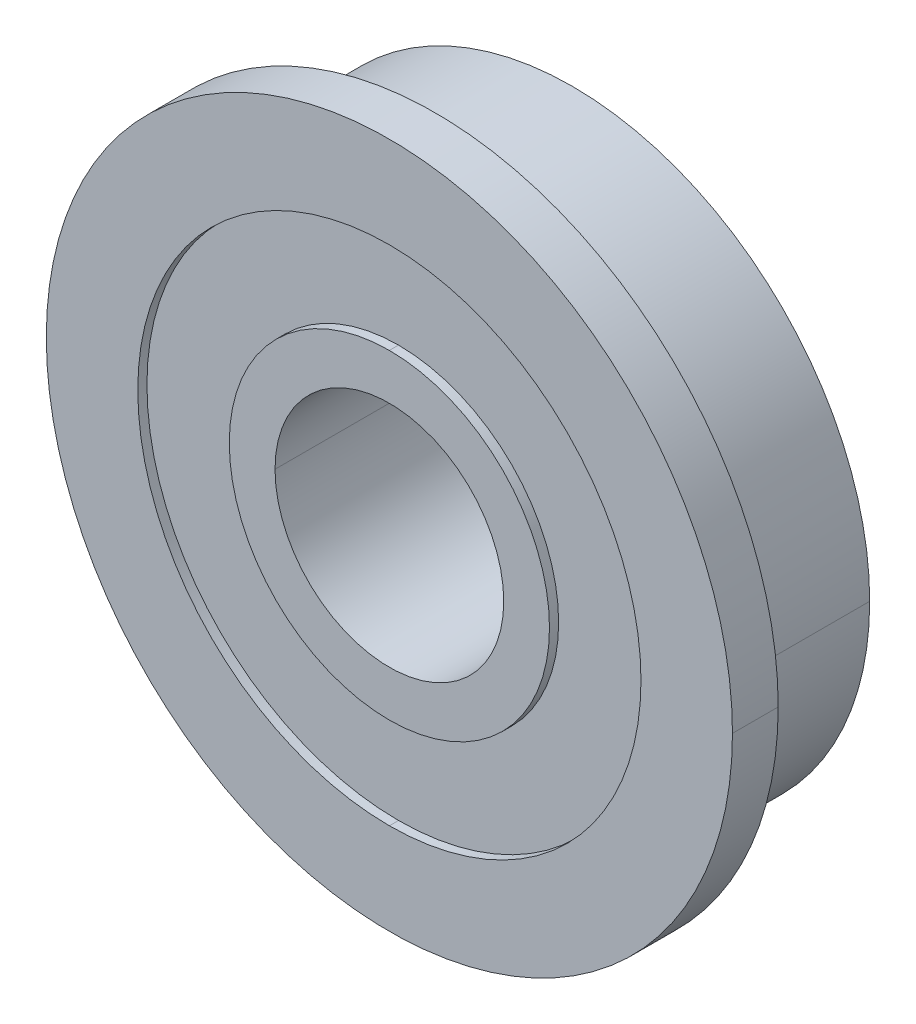
ISO-10303-21;
HEADER;
FILE_DESCRIPTION(('STEP AP214'),'2;1');
FILE_NAME('part.step','',(''),(''),'','','');
FILE_SCHEMA(('AUTOMOTIVE_DESIGN { 1 0 10303 214 1 1 1 1 }'));
ENDSEC;
DATA;
#1=APPLICATION_CONTEXT('core data for automotive mechanical design processes');
#2=APPLICATION_PROTOCOL_DEFINITION('international standard','automotive_design',2000,#1);
#3=PRODUCT_CONTEXT('',#1,'mechanical');
#4=PRODUCT('Part','Part','',(#3));
#5=PRODUCT_RELATED_PRODUCT_CATEGORY('part','',(#4));
#6=PRODUCT_DEFINITION_FORMATION('','',#4);
#7=PRODUCT_DEFINITION_CONTEXT('part definition',#1,'design');
#8=PRODUCT_DEFINITION('design','',#6,#7);
#9=PRODUCT_DEFINITION_SHAPE('','',#8);
#10=(LENGTH_UNIT() NAMED_UNIT(*) SI_UNIT(.MILLI.,.METRE.));
#11=(NAMED_UNIT(*) PLANE_ANGLE_UNIT() SI_UNIT($,.RADIAN.));
#12=(NAMED_UNIT(*) SI_UNIT($,.STERADIAN.) SOLID_ANGLE_UNIT());
#13=UNCERTAINTY_MEASURE_WITH_UNIT(LENGTH_MEASURE(1.E-05),#10,'distance_accuracy_value','');
#14=(GEOMETRIC_REPRESENTATION_CONTEXT(3) GLOBAL_UNCERTAINTY_ASSIGNED_CONTEXT((#13)) GLOBAL_UNIT_ASSIGNED_CONTEXT((#10,
#11,#12)) REPRESENTATION_CONTEXT('',''));
#15=CARTESIAN_POINT('',(0.,0.,0.));
#16=DIRECTION('',(0.,0.,1.));
#17=DIRECTION('',(1.,0.,0.));
#18=AXIS2_PLACEMENT_3D('',#15,#16,#17);
#19=CARTESIAN_POINT('',(0.,0.,-2.));
#20=DIRECTION('',(0.,0.,1.));
#21=DIRECTION('',(1.,0.,0.));
#22=AXIS2_PLACEMENT_3D('',#19,#20,#21);
#23=CYLINDRICAL_SURFACE('',#22,2.5);
#24=DIRECTION('',(0.,0.,1.));
#25=VECTOR('',#24,1.);
#26=CARTESIAN_POINT('',(2.5,0.,-2.));
#27=LINE('',#26,#25);
#28=CARTESIAN_POINT('',(2.5,0.,-2.));
#29=VERTEX_POINT('',#28);
#30=CARTESIAN_POINT('',(2.5,0.,2.));
#31=VERTEX_POINT('',#30);
#32=EDGE_CURVE('E11',#29,#31,#27,.T.);
#33=ORIENTED_EDGE('',*,*,#32,.T.);
#34=CARTESIAN_POINT('',(0.,0.,2.));
#35=DIRECTION('',(0.,0.,-1.));
#36=DIRECTION('',(-1.,0.,0.));
#37=AXIS2_PLACEMENT_3D('',#34,#35,#36);
#38=CIRCLE('',#37,2.5);
#39=CARTESIAN_POINT('',(-2.5,0.,2.));
#40=VERTEX_POINT('',#39);
#41=EDGE_CURVE('E25',#40,#31,#38,.T.);
#42=ORIENTED_EDGE('',*,*,#41,.F.);
#43=DIRECTION('',(0.,0.,1.));
#44=VECTOR('',#43,1.);
#45=CARTESIAN_POINT('',(-2.5,0.,-2.));
#46=LINE('',#45,#44);
#47=CARTESIAN_POINT('',(-2.5,0.,-2.));
#48=VERTEX_POINT('',#47);
#49=EDGE_CURVE('E269',#48,#40,#46,.T.);
#50=ORIENTED_EDGE('',*,*,#49,.F.);
#51=CARTESIAN_POINT('',(0.,0.,-2.));
#52=DIRECTION('',(0.,0.,-1.));
#53=DIRECTION('',(-1.,0.,0.));
#54=AXIS2_PLACEMENT_3D('',#51,#52,#53);
#55=CIRCLE('',#54,2.5);
#56=EDGE_CURVE('E266',#48,#29,#55,.T.);
#57=ORIENTED_EDGE('',*,*,#56,.T.);
#58=EDGE_LOOP('',(#33,#42,#50,#57));
#59=FACE_BOUND('',#58,.T.);
#60=ADVANCED_FACE('F17',(#59),#23,.F.);
#61=CARTESIAN_POINT('',(0.,0.,-2.));
#62=DIRECTION('',(0.,0.,-1.));
#63=DIRECTION('',(0.,1.,0.));
#64=AXIS2_PLACEMENT_3D('',#61,#62,#63);
#65=CYLINDRICAL_SURFACE('',#64,5.5);
#66=DIRECTION('',(0.,0.,1.));
#67=VECTOR('',#66,1.);
#68=CARTESIAN_POINT('',(0.,5.5,-2.));
#69=LINE('',#68,#67);
#70=CARTESIAN_POINT('',(0.,5.5,-2.));
#71=VERTEX_POINT('',#70);
#72=CARTESIAN_POINT('',(0.,5.5,-1.8));
#73=VERTEX_POINT('',#72);
#74=EDGE_CURVE('E263',#71,#73,#69,.T.);
#75=ORIENTED_EDGE('',*,*,#74,.T.);
#76=CARTESIAN_POINT('',(0.,0.,-1.8));
#77=DIRECTION('',(0.,0.,-1.));
#78=DIRECTION('',(0.,-1.,0.));
#79=AXIS2_PLACEMENT_3D('',#76,#77,#78);
#80=CIRCLE('',#79,5.5);
#81=CARTESIAN_POINT('',(0.,-5.5,-1.8));
#82=VERTEX_POINT('',#81);
#83=EDGE_CURVE('E259',#82,#73,#80,.T.);
#84=ORIENTED_EDGE('',*,*,#83,.F.);
#85=DIRECTION('',(0.,0.,1.));
#86=VECTOR('',#85,1.);
#87=CARTESIAN_POINT('',(0.,-5.5,-2.));
#88=LINE('',#87,#86);
#89=CARTESIAN_POINT('',(0.,-5.5,-2.));
#90=VERTEX_POINT('',#89);
#91=EDGE_CURVE('E255',#90,#82,#88,.T.);
#92=ORIENTED_EDGE('',*,*,#91,.F.);
#93=CARTESIAN_POINT('',(0.,0.,-2.));
#94=DIRECTION('',(0.,0.,-1.));
#95=DIRECTION('',(0.,-1.,0.));
#96=AXIS2_PLACEMENT_3D('',#93,#94,#95);
#97=CIRCLE('',#96,5.5);
#98=EDGE_CURVE('E252',#90,#71,#97,.T.);
#99=ORIENTED_EDGE('',*,*,#98,.T.);
#100=EDGE_LOOP('',(#75,#84,#92,#99));
#101=FACE_BOUND('',#100,.T.);
#102=ADVANCED_FACE('F300',(#101),#65,.F.);
#103=CARTESIAN_POINT('',(0.,0.,-2.));
#104=DIRECTION('',(0.,0.,-1.));
#105=DIRECTION('',(0.,1.,0.));
#106=AXIS2_PLACEMENT_3D('',#103,#104,#105);
#107=CYLINDRICAL_SURFACE('',#106,5.5);
#108=ORIENTED_EDGE('',*,*,#91,.T.);
#109=CARTESIAN_POINT('',(0.,0.,-1.8));
#110=DIRECTION('',(0.,0.,-1.));
#111=DIRECTION('',(0.,1.,0.));
#112=AXIS2_PLACEMENT_3D('',#109,#110,#111);
#113=CIRCLE('',#112,5.5);
#114=EDGE_CURVE('E248',#73,#82,#113,.T.);
#115=ORIENTED_EDGE('',*,*,#114,.F.);
#116=ORIENTED_EDGE('',*,*,#74,.F.);
#117=CARTESIAN_POINT('',(0.,0.,-2.));
#118=DIRECTION('',(0.,0.,-1.));
#119=DIRECTION('',(0.,1.,0.));
#120=AXIS2_PLACEMENT_3D('',#117,#118,#119);
#121=CIRCLE('',#120,5.5);
#122=EDGE_CURVE('E244',#71,#90,#121,.T.);
#123=ORIENTED_EDGE('',*,*,#122,.T.);
#124=EDGE_LOOP('',(#108,#115,#116,#123));
#125=FACE_BOUND('',#124,.T.);
#126=ADVANCED_FACE('F296',(#125),#107,.F.);
#127=CARTESIAN_POINT('',(0.,0.,-1.8));
#128=DIRECTION('',(0.,0.,-1.));
#129=DIRECTION('',(0.,1.,0.));
#130=AXIS2_PLACEMENT_3D('',#127,#128,#129);
#131=PLANE('',#130);
#132=CARTESIAN_POINT('',(0.,0.,-1.8));
#133=DIRECTION('',(0.,0.,1.));
#134=DIRECTION('',(0.,-1.,0.));
#135=AXIS2_PLACEMENT_3D('',#132,#133,#134);
#136=CIRCLE('',#135,3.5);
#137=CARTESIAN_POINT('',(0.,-3.5,-1.8));
#138=VERTEX_POINT('',#137);
#139=CARTESIAN_POINT('',(0.,3.5,-1.8));
#140=VERTEX_POINT('',#139);
#141=EDGE_CURVE('E241',#138,#140,#136,.T.);
#142=ORIENTED_EDGE('',*,*,#141,.T.);
#143=CARTESIAN_POINT('',(0.,0.,-1.8));
#144=DIRECTION('',(0.,0.,1.));
#145=DIRECTION('',(0.,1.,0.));
#146=AXIS2_PLACEMENT_3D('',#143,#144,#145);
#147=CIRCLE('',#146,3.5);
#148=EDGE_CURVE('E238',#140,#138,#147,.T.);
#149=ORIENTED_EDGE('',*,*,#148,.T.);
#150=EDGE_LOOP('',(#142,#149));
#151=FACE_BOUND('',#150,.T.);
#152=ORIENTED_EDGE('',*,*,#83,.T.);
#153=ORIENTED_EDGE('',*,*,#114,.T.);
#154=EDGE_LOOP('',(#152,#153));
#155=FACE_BOUND('',#154,.T.);
#156=ADVANCED_FACE('F293',(#151,#155),#131,.T.);
#157=CARTESIAN_POINT('',(0.,0.,-2.));
#158=DIRECTION('',(0.,0.,-1.));
#159=DIRECTION('',(0.,1.,0.));
#160=AXIS2_PLACEMENT_3D('',#157,#158,#159);
#161=CYLINDRICAL_SURFACE('',#160,3.5);
#162=DIRECTION('',(0.,0.,1.));
#163=VECTOR('',#162,1.);
#164=CARTESIAN_POINT('',(0.,3.5,-2.));
#165=LINE('',#164,#163);
#166=CARTESIAN_POINT('',(0.,3.5,-2.));
#167=VERTEX_POINT('',#166);
#168=EDGE_CURVE('E234',#167,#140,#165,.T.);
#169=ORIENTED_EDGE('',*,*,#168,.T.);
#170=ORIENTED_EDGE('',*,*,#141,.F.);
#171=DIRECTION('',(0.,0.,1.));
#172=VECTOR('',#171,1.);
#173=CARTESIAN_POINT('',(0.,-3.5,-2.));
#174=LINE('',#173,#172);
#175=CARTESIAN_POINT('',(0.,-3.5,-2.));
#176=VERTEX_POINT('',#175);
#177=EDGE_CURVE('E230',#176,#138,#174,.T.);
#178=ORIENTED_EDGE('',*,*,#177,.F.);
#179=CARTESIAN_POINT('',(0.,0.,-2.));
#180=DIRECTION('',(0.,0.,-1.));
#181=DIRECTION('',(0.,1.,0.));
#182=AXIS2_PLACEMENT_3D('',#179,#180,#181);
#183=CIRCLE('',#182,3.5);
#184=EDGE_CURVE('E226',#167,#176,#183,.T.);
#185=ORIENTED_EDGE('',*,*,#184,.F.);
#186=EDGE_LOOP('',(#169,#170,#178,#185));
#187=FACE_BOUND('',#186,.T.);
#188=ADVANCED_FACE('F288',(#187),#161,.T.);
#189=CARTESIAN_POINT('',(0.,0.,-2.));
#190=DIRECTION('',(0.,0.,-1.));
#191=DIRECTION('',(0.,1.,0.));
#192=AXIS2_PLACEMENT_3D('',#189,#190,#191);
#193=CYLINDRICAL_SURFACE('',#192,3.5);
#194=ORIENTED_EDGE('',*,*,#177,.T.);
#195=ORIENTED_EDGE('',*,*,#148,.F.);
#196=ORIENTED_EDGE('',*,*,#168,.F.);
#197=CARTESIAN_POINT('',(0.,0.,-2.));
#198=DIRECTION('',(0.,0.,-1.));
#199=DIRECTION('',(0.,-1.,0.));
#200=AXIS2_PLACEMENT_3D('',#197,#198,#199);
#201=CIRCLE('',#200,3.5);
#202=EDGE_CURVE('E222',#176,#167,#201,.T.);
#203=ORIENTED_EDGE('',*,*,#202,.F.);
#204=EDGE_LOOP('',(#194,#195,#196,#203));
#205=FACE_BOUND('',#204,.T.);
#206=ADVANCED_FACE('F283',(#205),#193,.T.);
#207=CARTESIAN_POINT('',(0.,0.,-2.));
#208=DIRECTION('',(0.,0.,1.));
#209=DIRECTION('',(1.,0.,0.));
#210=AXIS2_PLACEMENT_3D('',#207,#208,#209);
#211=PLANE('',#210);
#212=ORIENTED_EDGE('',*,*,#56,.F.);
#213=CARTESIAN_POINT('',(0.,0.,-2.));
#214=DIRECTION('',(0.,0.,-1.));
#215=DIRECTION('',(1.,0.,0.));
#216=AXIS2_PLACEMENT_3D('',#213,#214,#215);
#217=CIRCLE('',#216,2.5);
#218=EDGE_CURVE('E218',#29,#48,#217,.T.);
#219=ORIENTED_EDGE('',*,*,#218,.F.);
#220=EDGE_LOOP('',(#212,#219));
#221=FACE_BOUND('',#220,.T.);
#222=ORIENTED_EDGE('',*,*,#184,.T.);
#223=ORIENTED_EDGE('',*,*,#202,.T.);
#224=EDGE_LOOP('',(#222,#223));
#225=FACE_BOUND('',#224,.T.);
#226=ADVANCED_FACE('F280',(#221,#225),#211,.F.);
#227=CARTESIAN_POINT('',(0.,0.,-2.));
#228=DIRECTION('',(0.,0.,1.));
#229=DIRECTION('',(1.,0.,0.));
#230=AXIS2_PLACEMENT_3D('',#227,#228,#229);
#231=CYLINDRICAL_SURFACE('',#230,2.5);
#232=ORIENTED_EDGE('',*,*,#49,.T.);
#233=CARTESIAN_POINT('',(0.,0.,2.));
#234=DIRECTION('',(0.,0.,-1.));
#235=DIRECTION('',(1.,0.,0.));
#236=AXIS2_PLACEMENT_3D('',#233,#234,#235);
#237=CIRCLE('',#236,2.5);
#238=EDGE_CURVE('E214',#31,#40,#237,.T.);
#239=ORIENTED_EDGE('',*,*,#238,.F.);
#240=ORIENTED_EDGE('',*,*,#32,.F.);
#241=ORIENTED_EDGE('',*,*,#218,.T.);
#242=EDGE_LOOP('',(#232,#239,#240,#241));
#243=FACE_BOUND('',#242,.T.);
#244=ADVANCED_FACE('F276',(#243),#231,.F.);
#245=CARTESIAN_POINT('',(0.,0.,2.));
#246=DIRECTION('',(0.,0.,1.));
#247=DIRECTION('',(1.,0.,0.));
#248=AXIS2_PLACEMENT_3D('',#245,#246,#247);
#249=PLANE('',#248);
#250=ORIENTED_EDGE('',*,*,#41,.T.);
#251=ORIENTED_EDGE('',*,*,#238,.T.);
#252=EDGE_LOOP('',(#250,#251));
#253=FACE_BOUND('',#252,.T.);
#254=CARTESIAN_POINT('',(0.,0.,2.));
#255=DIRECTION('',(0.,0.,-1.));
#256=DIRECTION('',(0.,1.,0.));
#257=AXIS2_PLACEMENT_3D('',#254,#255,#256);
#258=CIRCLE('',#257,3.5);
#259=CARTESIAN_POINT('',(0.,3.5,2.));
#260=VERTEX_POINT('',#259);
#261=CARTESIAN_POINT('',(0.,-3.5,2.));
#262=VERTEX_POINT('',#261);
#263=EDGE_CURVE('E210',#260,#262,#258,.T.);
#264=ORIENTED_EDGE('',*,*,#263,.F.);
#265=CARTESIAN_POINT('',(0.,0.,2.));
#266=DIRECTION('',(0.,0.,-1.));
#267=DIRECTION('',(0.,-1.,0.));
#268=AXIS2_PLACEMENT_3D('',#265,#266,#267);
#269=CIRCLE('',#268,3.5);
#270=EDGE_CURVE('E206',#262,#260,#269,.T.);
#271=ORIENTED_EDGE('',*,*,#270,.F.);
#272=EDGE_LOOP('',(#264,#271));
#273=FACE_BOUND('',#272,.T.);
#274=ADVANCED_FACE('F273',(#253,#273),#249,.T.);
#275=CARTESIAN_POINT('',(0.,0.,2.));
#276=DIRECTION('',(0.,0.,-1.));
#277=DIRECTION('',(0.,1.,0.));
#278=AXIS2_PLACEMENT_3D('',#275,#276,#277);
#279=CYLINDRICAL_SURFACE('',#278,3.5);
#280=ORIENTED_EDGE('',*,*,#263,.T.);
#281=DIRECTION('',(0.,0.,-1.));
#282=VECTOR('',#281,1.);
#283=CARTESIAN_POINT('',(0.,-3.5,2.));
#284=LINE('',#283,#282);
#285=CARTESIAN_POINT('',(0.,-3.5,1.8));
#286=VERTEX_POINT('',#285);
#287=EDGE_CURVE('E203',#262,#286,#284,.T.);
#288=ORIENTED_EDGE('',*,*,#287,.T.);
#289=CARTESIAN_POINT('',(0.,0.,1.8));
#290=DIRECTION('',(0.,0.,1.));
#291=DIRECTION('',(0.,-1.,0.));
#292=AXIS2_PLACEMENT_3D('',#289,#290,#291);
#293=CIRCLE('',#292,3.5);
#294=CARTESIAN_POINT('',(0.,3.5,1.8));
#295=VERTEX_POINT('',#294);
#296=EDGE_CURVE('E200',#286,#295,#293,.T.);
#297=ORIENTED_EDGE('',*,*,#296,.T.);
#298=DIRECTION('',(0.,0.,-1.));
#299=VECTOR('',#298,1.);
#300=CARTESIAN_POINT('',(0.,3.5,2.));
#301=LINE('',#300,#299);
#302=EDGE_CURVE('E196',#260,#295,#301,.T.);
#303=ORIENTED_EDGE('',*,*,#302,.F.);
#304=EDGE_LOOP('',(#280,#288,#297,#303));
#305=FACE_BOUND('',#304,.T.);
#306=ADVANCED_FACE('F330',(#305),#279,.T.);
#307=CARTESIAN_POINT('',(0.,0.,2.));
#308=DIRECTION('',(0.,0.,-1.));
#309=DIRECTION('',(0.,1.,0.));
#310=AXIS2_PLACEMENT_3D('',#307,#308,#309);
#311=CYLINDRICAL_SURFACE('',#310,3.5);
#312=CARTESIAN_POINT('',(0.,0.,1.8));
#313=DIRECTION('',(0.,0.,1.));
#314=DIRECTION('',(0.,1.,0.));
#315=AXIS2_PLACEMENT_3D('',#312,#313,#314);
#316=CIRCLE('',#315,3.5);
#317=EDGE_CURVE('E192',#295,#286,#316,.T.);
#318=ORIENTED_EDGE('',*,*,#317,.T.);
#319=ORIENTED_EDGE('',*,*,#287,.F.);
#320=ORIENTED_EDGE('',*,*,#270,.T.);
#321=ORIENTED_EDGE('',*,*,#302,.T.);
#322=EDGE_LOOP('',(#318,#319,#320,#321));
#323=FACE_BOUND('',#322,.T.);
#324=ADVANCED_FACE('F333',(#323),#311,.T.);
#325=CARTESIAN_POINT('',(0.,0.,1.8));
#326=DIRECTION('',(0.,0.,-1.));
#327=DIRECTION('',(0.,1.,0.));
#328=AXIS2_PLACEMENT_3D('',#325,#326,#327);
#329=PLANE('',#328);
#330=ORIENTED_EDGE('',*,*,#296,.F.);
#331=ORIENTED_EDGE('',*,*,#317,.F.);
#332=EDGE_LOOP('',(#330,#331));
#333=FACE_BOUND('',#332,.T.);
#334=CARTESIAN_POINT('',(0.,0.,1.8));
#335=DIRECTION('',(0.,0.,-1.));
#336=DIRECTION('',(0.,-1.,0.));
#337=AXIS2_PLACEMENT_3D('',#334,#335,#336);
#338=CIRCLE('',#337,5.5);
#339=CARTESIAN_POINT('',(0.,-5.5,1.8));
#340=VERTEX_POINT('',#339);
#341=CARTESIAN_POINT('',(0.,5.5,1.8));
#342=VERTEX_POINT('',#341);
#343=EDGE_CURVE('E188',#340,#342,#338,.T.);
#344=ORIENTED_EDGE('',*,*,#343,.F.);
#345=CARTESIAN_POINT('',(0.,0.,1.8));
#346=DIRECTION('',(0.,0.,-1.));
#347=DIRECTION('',(0.,1.,0.));
#348=AXIS2_PLACEMENT_3D('',#345,#346,#347);
#349=CIRCLE('',#348,5.5);
#350=EDGE_CURVE('E184',#342,#340,#349,.T.);
#351=ORIENTED_EDGE('',*,*,#350,.F.);
#352=EDGE_LOOP('',(#344,#351));
#353=FACE_BOUND('',#352,.T.);
#354=ADVANCED_FACE('F337',(#333,#353),#329,.F.);
#355=CARTESIAN_POINT('',(0.,0.,2.));
#356=DIRECTION('',(0.,0.,-1.));
#357=DIRECTION('',(0.,1.,0.));
#358=AXIS2_PLACEMENT_3D('',#355,#356,#357);
#359=CYLINDRICAL_SURFACE('',#358,5.5);
#360=CARTESIAN_POINT('',(0.,0.,2.));
#361=DIRECTION('',(0.,0.,-1.));
#362=DIRECTION('',(0.,-1.,0.));
#363=AXIS2_PLACEMENT_3D('',#360,#361,#362);
#364=CIRCLE('',#363,5.5);
#365=CARTESIAN_POINT('',(0.,-5.5,2.));
#366=VERTEX_POINT('',#365);
#367=CARTESIAN_POINT('',(0.,5.5,2.));
#368=VERTEX_POINT('',#367);
#369=EDGE_CURVE('E180',#366,#368,#364,.T.);
#370=ORIENTED_EDGE('',*,*,#369,.F.);
#371=DIRECTION('',(0.,0.,-1.));
#372=VECTOR('',#371,1.);
#373=CARTESIAN_POINT('',(0.,-5.5,2.));
#374=LINE('',#373,#372);
#375=EDGE_CURVE('E176',#366,#340,#374,.T.);
#376=ORIENTED_EDGE('',*,*,#375,.T.);
#377=ORIENTED_EDGE('',*,*,#343,.T.);
#378=DIRECTION('',(0.,0.,-1.));
#379=VECTOR('',#378,1.);
#380=CARTESIAN_POINT('',(0.,5.5,2.));
#381=LINE('',#380,#379);
#382=EDGE_CURVE('E172',#368,#342,#381,.T.);
#383=ORIENTED_EDGE('',*,*,#382,.F.);
#384=EDGE_LOOP('',(#370,#376,#377,#383));
#385=FACE_BOUND('',#384,.T.);
#386=ADVANCED_FACE('F341',(#385),#359,.F.);
#387=CARTESIAN_POINT('',(0.,0.,2.));
#388=DIRECTION('',(0.,0.,-1.));
#389=DIRECTION('',(0.,1.,0.));
#390=AXIS2_PLACEMENT_3D('',#387,#388,#389);
#391=CYLINDRICAL_SURFACE('',#390,5.5);
#392=ORIENTED_EDGE('',*,*,#350,.T.);
#393=ORIENTED_EDGE('',*,*,#375,.F.);
#394=CARTESIAN_POINT('',(0.,0.,2.));
#395=DIRECTION('',(0.,0.,-1.));
#396=DIRECTION('',(0.,1.,0.));
#397=AXIS2_PLACEMENT_3D('',#394,#395,#396);
#398=CIRCLE('',#397,5.5);
#399=EDGE_CURVE('E168',#368,#366,#398,.T.);
#400=ORIENTED_EDGE('',*,*,#399,.F.);
#401=ORIENTED_EDGE('',*,*,#382,.T.);
#402=EDGE_LOOP('',(#392,#393,#400,#401));
#403=FACE_BOUND('',#402,.T.);
#404=ADVANCED_FACE('F345',(#403),#391,.F.);
#405=CARTESIAN_POINT('',(0.,0.,2.));
#406=DIRECTION('',(0.,0.,1.));
#407=DIRECTION('',(1.,0.,0.));
#408=AXIS2_PLACEMENT_3D('',#405,#406,#407);
#409=CYLINDRICAL_SURFACE('',#408,7.5);
#410=DIRECTION('',(0.,0.,1.));
#411=VECTOR('',#410,1.);
#412=CARTESIAN_POINT('',(-7.5,0.,1.));
#413=LINE('',#412,#411);
#414=CARTESIAN_POINT('',(-7.5,0.,1.));
#415=VERTEX_POINT('',#414);
#416=CARTESIAN_POINT('',(-7.5,0.,2.));
#417=VERTEX_POINT('',#416);
#418=EDGE_CURVE('E164',#415,#417,#413,.T.);
#419=ORIENTED_EDGE('',*,*,#418,.F.);
#420=CARTESIAN_POINT('',(0.,0.,0.999999999999999));
#421=DIRECTION('',(0.,0.,-1.));
#422=DIRECTION('',(1.,0.,0.));
#423=AXIS2_PLACEMENT_3D('',#420,#421,#422);
#424=CIRCLE('',#423,7.5);
#425=CARTESIAN_POINT('',(7.5,0.,1.));
#426=VERTEX_POINT('',#425);
#427=EDGE_CURVE('E160',#426,#415,#424,.T.);
#428=ORIENTED_EDGE('',*,*,#427,.F.);
#429=DIRECTION('',(0.,0.,1.));
#430=VECTOR('',#429,1.);
#431=CARTESIAN_POINT('',(7.5,0.,1.));
#432=LINE('',#431,#430);
#433=CARTESIAN_POINT('',(7.5,0.,2.));
#434=VERTEX_POINT('',#433);
#435=EDGE_CURVE('E157',#426,#434,#432,.T.);
#436=ORIENTED_EDGE('',*,*,#435,.T.);
#437=CARTESIAN_POINT('',(0.,0.,2.));
#438=DIRECTION('',(0.,0.,1.));
#439=DIRECTION('',(-1.,0.,0.));
#440=AXIS2_PLACEMENT_3D('',#437,#438,#439);
#441=CIRCLE('',#440,7.5);
#442=EDGE_CURVE('E153',#417,#434,#441,.T.);
#443=ORIENTED_EDGE('',*,*,#442,.F.);
#444=EDGE_LOOP('',(#419,#428,#436,#443));
#445=FACE_BOUND('',#444,.T.);
#446=ADVANCED_FACE('F349',(#445),#409,.T.);
#447=CARTESIAN_POINT('',(0.,0.,2.));
#448=DIRECTION('',(0.,0.,1.));
#449=DIRECTION('',(1.,0.,0.));
#450=AXIS2_PLACEMENT_3D('',#447,#448,#449);
#451=PLANE('',#450);
#452=ORIENTED_EDGE('',*,*,#369,.T.);
#453=ORIENTED_EDGE('',*,*,#399,.T.);
#454=EDGE_LOOP('',(#452,#453));
#455=FACE_BOUND('',#454,.T.);
#456=ORIENTED_EDGE('',*,*,#442,.T.);
#457=CARTESIAN_POINT('',(0.,0.,2.));
#458=DIRECTION('',(0.,0.,1.));
#459=DIRECTION('',(1.,0.,0.));
#460=AXIS2_PLACEMENT_3D('',#457,#458,#459);
#461=CIRCLE('',#460,7.5);
#462=EDGE_CURVE('E149',#434,#417,#461,.T.);
#463=ORIENTED_EDGE('',*,*,#462,.T.);
#464=EDGE_LOOP('',(#456,#463));
#465=FACE_BOUND('',#464,.T.);
#466=ADVANCED_FACE('F353',(#455,#465),#451,.T.);
#467=CARTESIAN_POINT('',(0.,0.,2.));
#468=DIRECTION('',(0.,0.,1.));
#469=DIRECTION('',(1.,0.,0.));
#470=AXIS2_PLACEMENT_3D('',#467,#468,#469);
#471=CYLINDRICAL_SURFACE('',#470,7.5);
#472=ORIENTED_EDGE('',*,*,#435,.F.);
#473=CARTESIAN_POINT('',(0.,0.,0.999999999999999));
#474=DIRECTION('',(0.,0.,-1.));
#475=DIRECTION('',(-1.,0.,0.));
#476=AXIS2_PLACEMENT_3D('',#473,#474,#475);
#477=CIRCLE('',#476,7.5);
#478=EDGE_CURVE('E145',#415,#426,#477,.T.);
#479=ORIENTED_EDGE('',*,*,#478,.F.);
#480=ORIENTED_EDGE('',*,*,#418,.T.);
#481=ORIENTED_EDGE('',*,*,#462,.F.);
#482=EDGE_LOOP('',(#472,#479,#480,#481));
#483=FACE_BOUND('',#482,.T.);
#484=ADVANCED_FACE('F357',(#483),#471,.T.);
#485=CARTESIAN_POINT('',(0.,0.,1.));
#486=DIRECTION('',(0.,0.,1.));
#487=DIRECTION('',(1.,0.,0.));
#488=AXIS2_PLACEMENT_3D('',#485,#486,#487);
#489=PLANE('',#488);
#490=CARTESIAN_POINT('',(0.,0.,1.));
#491=DIRECTION('',(0.,0.,1.));
#492=DIRECTION('',(-1.,0.,0.));
#493=AXIS2_PLACEMENT_3D('',#490,#491,#492);
#494=CIRCLE('',#493,6.5);
#495=CARTESIAN_POINT('',(-6.5,0.,1.));
#496=VERTEX_POINT('',#495);
#497=CARTESIAN_POINT('',(6.5,0.,1.));
#498=VERTEX_POINT('',#497);
#499=EDGE_CURVE('E142',#496,#498,#494,.T.);
#500=ORIENTED_EDGE('',*,*,#499,.T.);
#501=CARTESIAN_POINT('',(0.,0.,1.));
#502=DIRECTION('',(0.,0.,1.));
#503=DIRECTION('',(1.,0.,0.));
#504=AXIS2_PLACEMENT_3D('',#501,#502,#503);
#505=CIRCLE('',#504,6.5);
#506=EDGE_CURVE('E130',#498,#496,#505,.T.);
#507=ORIENTED_EDGE('',*,*,#506,.T.);
#508=EDGE_LOOP('',(#500,#507));
#509=FACE_BOUND('',#508,.T.);
#510=ORIENTED_EDGE('',*,*,#427,.T.);
#511=ORIENTED_EDGE('',*,*,#478,.T.);
#512=EDGE_LOOP('',(#510,#511));
#513=FACE_BOUND('',#512,.T.);
#514=ADVANCED_FACE('F361',(#509,#513),#489,.F.);
#515=CARTESIAN_POINT('',(0.,0.,-2.));
#516=DIRECTION('',(0.,0.,1.));
#517=DIRECTION('',(1.,0.,0.));
#518=AXIS2_PLACEMENT_3D('',#515,#516,#517);
#519=CYLINDRICAL_SURFACE('',#518,6.5);
#520=ORIENTED_EDGE('',*,*,#499,.F.);
#521=DIRECTION('',(0.,0.,1.));
#522=VECTOR('',#521,1.);
#523=CARTESIAN_POINT('',(-6.5,0.,-2.));
#524=LINE('',#523,#522);
#525=CARTESIAN_POINT('',(-6.5,0.,-2.));
#526=VERTEX_POINT('',#525);
#527=EDGE_CURVE('E121',#526,#496,#524,.T.);
#528=ORIENTED_EDGE('',*,*,#527,.F.);
#529=CARTESIAN_POINT('',(0.,0.,-2.));
#530=DIRECTION('',(0.,0.,1.));
#531=DIRECTION('',(-1.,0.,0.));
#532=AXIS2_PLACEMENT_3D('',#529,#530,#531);
#533=CIRCLE('',#532,6.5);
#534=CARTESIAN_POINT('',(6.5,0.,-2.));
#535=VERTEX_POINT('',#534);
#536=EDGE_CURVE('E114',#526,#535,#533,.T.);
#537=ORIENTED_EDGE('',*,*,#536,.T.);
#538=DIRECTION('',(0.,0.,1.));
#539=VECTOR('',#538,1.);
#540=CARTESIAN_POINT('',(6.5,0.,-2.));
#541=LINE('',#540,#539);
#542=EDGE_CURVE('E118',#535,#498,#541,.T.);
#543=ORIENTED_EDGE('',*,*,#542,.T.);
#544=EDGE_LOOP('',(#520,#528,#537,#543));
#545=FACE_BOUND('',#544,.T.);
#546=ADVANCED_FACE('F117',(#545),#519,.T.);
#547=CARTESIAN_POINT('',(0.,0.,-2.));
#548=DIRECTION('',(0.,0.,1.));
#549=DIRECTION('',(1.,0.,0.));
#550=AXIS2_PLACEMENT_3D('',#547,#548,#549);
#551=CYLINDRICAL_SURFACE('',#550,6.5);
#552=CARTESIAN_POINT('',(0.,0.,-2.));
#553=DIRECTION('',(0.,0.,1.));
#554=DIRECTION('',(1.,0.,0.));
#555=AXIS2_PLACEMENT_3D('',#552,#553,#554);
#556=CIRCLE('',#555,6.5);
#557=EDGE_CURVE('E129',#535,#526,#556,.T.);
#558=ORIENTED_EDGE('',*,*,#557,.T.);
#559=ORIENTED_EDGE('',*,*,#527,.T.);
#560=ORIENTED_EDGE('',*,*,#506,.F.);
#561=ORIENTED_EDGE('',*,*,#542,.F.);
#562=EDGE_LOOP('',(#558,#559,#560,#561));
#563=FACE_BOUND('',#562,.T.);
#564=ADVANCED_FACE('F128',(#563),#551,.T.);
#565=CARTESIAN_POINT('',(0.,0.,-2.));
#566=DIRECTION('',(0.,0.,1.));
#567=DIRECTION('',(1.,0.,0.));
#568=AXIS2_PLACEMENT_3D('',#565,#566,#567);
#569=PLANE('',#568);
#570=ORIENTED_EDGE('',*,*,#98,.F.);
#571=ORIENTED_EDGE('',*,*,#122,.F.);
#572=EDGE_LOOP('',(#570,#571));
#573=FACE_BOUND('',#572,.T.);
#574=ORIENTED_EDGE('',*,*,#536,.F.);
#575=ORIENTED_EDGE('',*,*,#557,.F.);
#576=EDGE_LOOP('',(#574,#575));
#577=FACE_BOUND('',#576,.T.);
#578=ADVANCED_FACE('F133',(#573,#577),#569,.F.);
#579=CLOSED_SHELL('',(#60,#102,#126,#156,#188,#206,#226,#244,#274,#306,#324,#354,#386,#404,#446,
#466,#484,#514,#546,#564,#578));
#580=MANIFOLD_SOLID_BREP('B1',#579);
#581=ADVANCED_BREP_SHAPE_REPRESENTATION('',(#18,#580),#14);
#582=SHAPE_DEFINITION_REPRESENTATION(#9,#581);
ENDSEC;
END-ISO-10303-21;
